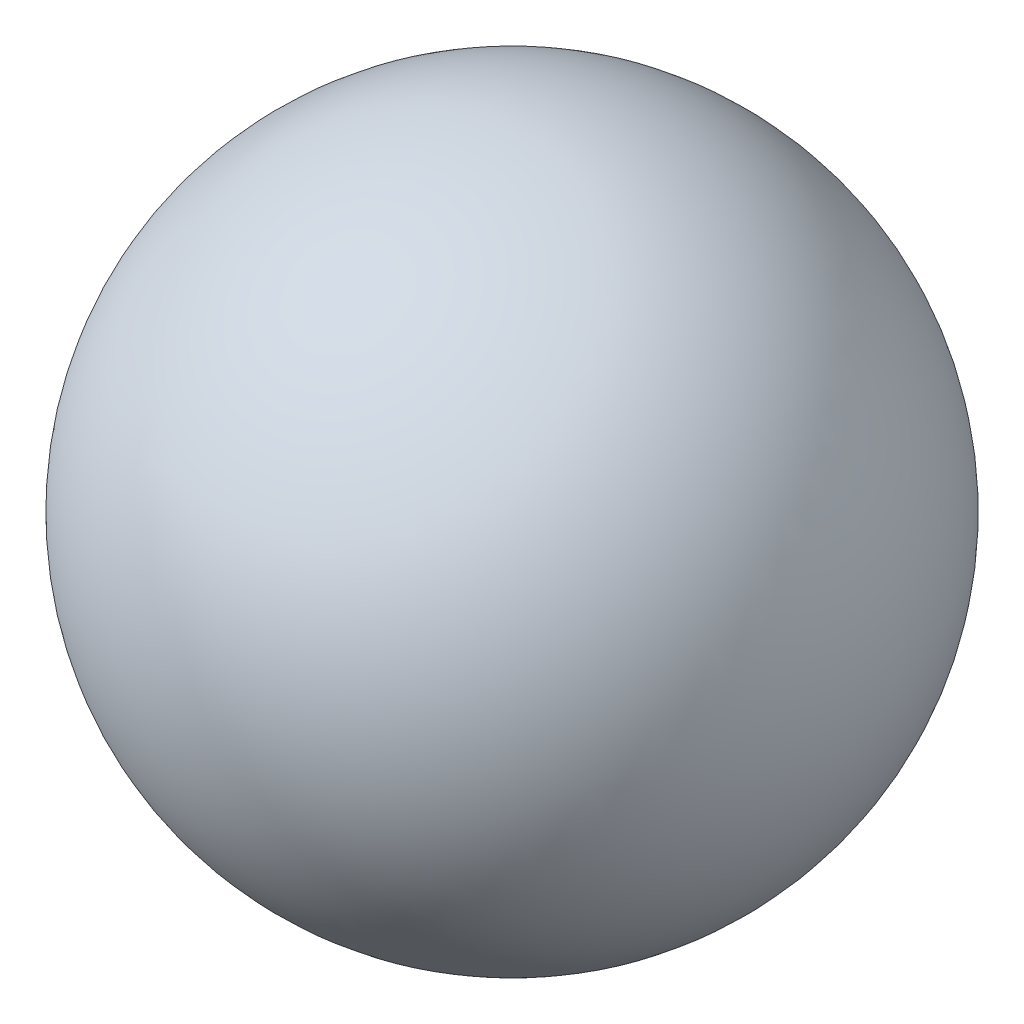
ISO-10303-21;
HEADER;
FILE_DESCRIPTION(('STEP AP214'),'2;1');
FILE_NAME('part.step','',(''),(''),'','','');
FILE_SCHEMA(('AUTOMOTIVE_DESIGN { 1 0 10303 214 1 1 1 1 }'));
ENDSEC;
DATA;
#1=APPLICATION_CONTEXT('core data for automotive mechanical design processes');
#2=APPLICATION_PROTOCOL_DEFINITION('international standard','automotive_design',2000,#1);
#3=PRODUCT_CONTEXT('',#1,'mechanical');
#4=PRODUCT('Part','Part','',(#3));
#5=PRODUCT_RELATED_PRODUCT_CATEGORY('part','',(#4));
#6=PRODUCT_DEFINITION_FORMATION('','',#4);
#7=PRODUCT_DEFINITION_CONTEXT('part definition',#1,'design');
#8=PRODUCT_DEFINITION('design','',#6,#7);
#9=PRODUCT_DEFINITION_SHAPE('','',#8);
#10=(LENGTH_UNIT() NAMED_UNIT(*) SI_UNIT(.MILLI.,.METRE.));
#11=(NAMED_UNIT(*) PLANE_ANGLE_UNIT() SI_UNIT($,.RADIAN.));
#12=(NAMED_UNIT(*) SI_UNIT($,.STERADIAN.) SOLID_ANGLE_UNIT());
#13=UNCERTAINTY_MEASURE_WITH_UNIT(LENGTH_MEASURE(1.E-05),#10,'distance_accuracy_value','');
#14=(GEOMETRIC_REPRESENTATION_CONTEXT(3) GLOBAL_UNCERTAINTY_ASSIGNED_CONTEXT((#13)) GLOBAL_UNIT_ASSIGNED_CONTEXT((#10,
#11,#12)) REPRESENTATION_CONTEXT('',''));
#15=CARTESIAN_POINT('',(0.,0.,0.));
#16=DIRECTION('',(0.,0.,1.));
#17=DIRECTION('',(1.,0.,0.));
#18=AXIS2_PLACEMENT_3D('',#15,#16,#17);
#19=CARTESIAN_POINT('',(0.,0.,0.));
#20=DIRECTION('',(0.,1.,0.));
#21=DIRECTION('',(1.,0.,0.));
#22=AXIS2_PLACEMENT_3D('',#19,#20,#21);
#23=SPHERICAL_SURFACE('',#22,125.);
#24=CARTESIAN_POINT('',(0.,125.,0.));
#25=VERTEX_POINT('',#24);
#26=VERTEX_LOOP('',#25);
#27=FACE_BOUND('',#26,.T.);
#28=ADVANCED_FACE('F30',(#27),#23,.T.);
#29=CLOSED_SHELL('',(#28));
#30=MANIFOLD_SOLID_BREP('B2',#29);
#31=ADVANCED_BREP_SHAPE_REPRESENTATION('',(#18,#30),#14);
#32=SHAPE_DEFINITION_REPRESENTATION(#9,#31);
ENDSEC;
END-ISO-10303-21;
